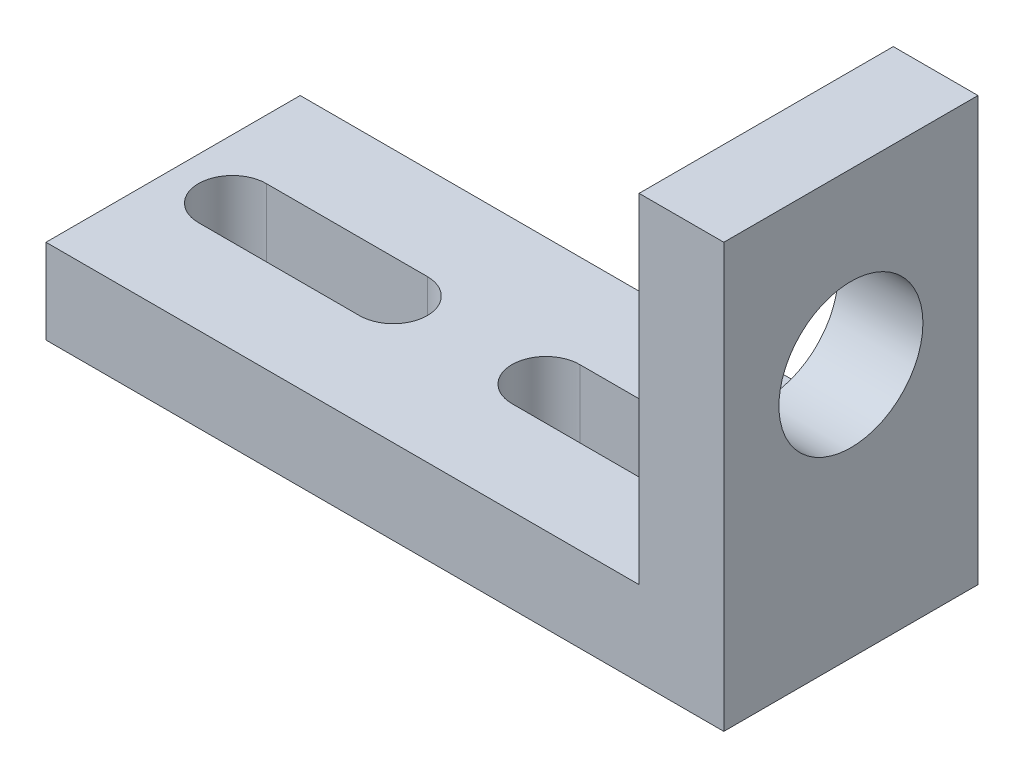
ISO-10303-21;
HEADER;
FILE_DESCRIPTION(('STEP AP214'),'2;1');
FILE_NAME('part.step','',(''),(''),'','','');
FILE_SCHEMA(('AUTOMOTIVE_DESIGN { 1 0 10303 214 1 1 1 1 }'));
ENDSEC;
DATA;
#1=APPLICATION_CONTEXT('core data for automotive mechanical design processes');
#2=APPLICATION_PROTOCOL_DEFINITION('international standard','automotive_design',2000,#1);
#3=PRODUCT_CONTEXT('',#1,'mechanical');
#4=PRODUCT('Part','Part','',(#3));
#5=PRODUCT_RELATED_PRODUCT_CATEGORY('part','',(#4));
#6=PRODUCT_DEFINITION_FORMATION('','',#4);
#7=PRODUCT_DEFINITION_CONTEXT('part definition',#1,'design');
#8=PRODUCT_DEFINITION('design','',#6,#7);
#9=PRODUCT_DEFINITION_SHAPE('','',#8);
#10=(LENGTH_UNIT() NAMED_UNIT(*) SI_UNIT(.MILLI.,.METRE.));
#11=(NAMED_UNIT(*) PLANE_ANGLE_UNIT() SI_UNIT($,.RADIAN.));
#12=(NAMED_UNIT(*) SI_UNIT($,.STERADIAN.) SOLID_ANGLE_UNIT());
#13=UNCERTAINTY_MEASURE_WITH_UNIT(LENGTH_MEASURE(1.E-05),#10,'distance_accuracy_value','');
#14=(GEOMETRIC_REPRESENTATION_CONTEXT(3) GLOBAL_UNCERTAINTY_ASSIGNED_CONTEXT((#13)) GLOBAL_UNIT_ASSIGNED_CONTEXT((#10,
#11,#12)) REPRESENTATION_CONTEXT('',''));
#15=CARTESIAN_POINT('',(0.,0.,0.));
#16=DIRECTION('',(0.,0.,1.));
#17=DIRECTION('',(1.,0.,0.));
#18=AXIS2_PLACEMENT_3D('',#15,#16,#17);
#19=CARTESIAN_POINT('',(0.,5.,0.));
#20=DIRECTION('',(0.,-1.,0.));
#21=DIRECTION('',(0.,0.,-1.));
#22=AXIS2_PLACEMENT_3D('',#19,#20,#21);
#23=PLANE('',#22);
#24=DIRECTION('',(1.,0.,0.));
#25=VECTOR('',#24,1.);
#26=CARTESIAN_POINT('',(-16.5,5.,2.));
#27=LINE('',#26,#25);
#28=CARTESIAN_POINT('',(-16.5,5.,2.));
#29=VERTEX_POINT('',#28);
#30=CARTESIAN_POINT('',(-7.,5.,2.));
#31=VERTEX_POINT('',#30);
#32=EDGE_CURVE('E150',#29,#31,#27,.T.);
#33=ORIENTED_EDGE('',*,*,#32,.F.);
#34=CARTESIAN_POINT('',(-16.5,5.,0.));
#35=DIRECTION('',(0.,1.,0.));
#36=DIRECTION('',(0.,0.,1.));
#37=AXIS2_PLACEMENT_3D('',#34,#35,#36);
#38=CIRCLE('',#37,2.);
#39=CARTESIAN_POINT('',(-16.5,5.,-2.));
#40=VERTEX_POINT('',#39);
#41=EDGE_CURVE('E48',#40,#29,#38,.T.);
#42=ORIENTED_EDGE('',*,*,#41,.F.);
#43=DIRECTION('',(-1.,0.,0.));
#44=VECTOR('',#43,1.);
#45=CARTESIAN_POINT('',(-16.5,5.,-2.));
#46=LINE('',#45,#44);
#47=CARTESIAN_POINT('',(-7.,5.,-2.));
#48=VERTEX_POINT('',#47);
#49=EDGE_CURVE('E156',#48,#40,#46,.T.);
#50=ORIENTED_EDGE('',*,*,#49,.F.);
#51=CARTESIAN_POINT('',(-7.,5.,0.));
#52=DIRECTION('',(0.,1.,0.));
#53=DIRECTION('',(0.,0.,1.));
#54=AXIS2_PLACEMENT_3D('',#51,#52,#53);
#55=CIRCLE('',#54,2.);
#56=EDGE_CURVE('E140',#31,#48,#55,.T.);
#57=ORIENTED_EDGE('',*,*,#56,.F.);
#58=EDGE_LOOP('',(#33,#42,#50,#57));
#59=FACE_BOUND('',#58,.T.);
#60=DIRECTION('',(-1.,0.,0.));
#61=VECTOR('',#60,1.);
#62=CARTESIAN_POINT('',(11.5,5.,-2.));
#63=LINE('',#62,#61);
#64=CARTESIAN_POINT('',(11.5,5.,-2.));
#65=VERTEX_POINT('',#64);
#66=CARTESIAN_POINT('',(2.00000000000001,5.,-2.));
#67=VERTEX_POINT('',#66);
#68=EDGE_CURVE('E167',#65,#67,#63,.T.);
#69=ORIENTED_EDGE('',*,*,#68,.F.);
#70=CARTESIAN_POINT('',(11.5,5.,0.));
#71=DIRECTION('',(0.,1.,0.));
#72=DIRECTION('',(0.,0.,-1.));
#73=AXIS2_PLACEMENT_3D('',#70,#71,#72);
#74=CIRCLE('',#73,2.);
#75=CARTESIAN_POINT('',(11.5,5.,1.99999999999999));
#76=VERTEX_POINT('',#75);
#77=EDGE_CURVE('E56',#76,#65,#74,.T.);
#78=ORIENTED_EDGE('',*,*,#77,.F.);
#79=DIRECTION('',(1.,0.,0.));
#80=VECTOR('',#79,1.);
#81=CARTESIAN_POINT('',(11.5,5.,1.99999999999999));
#82=LINE('',#81,#80);
#83=CARTESIAN_POINT('',(2.00000000000001,5.,2.));
#84=VERTEX_POINT('',#83);
#85=EDGE_CURVE('E173',#84,#76,#82,.T.);
#86=ORIENTED_EDGE('',*,*,#85,.F.);
#87=CARTESIAN_POINT('',(2.00000000000001,5.,0.));
#88=DIRECTION('',(0.,1.,0.));
#89=DIRECTION('',(0.,0.,-1.));
#90=AXIS2_PLACEMENT_3D('',#87,#88,#89);
#91=CIRCLE('',#90,2.);
#92=EDGE_CURVE('E170',#67,#84,#91,.T.);
#93=ORIENTED_EDGE('',*,*,#92,.F.);
#94=EDGE_LOOP('',(#69,#78,#86,#93));
#95=FACE_BOUND('',#94,.T.);
#96=DIRECTION('',(0.,0.,1.));
#97=VECTOR('',#96,1.);
#98=CARTESIAN_POINT('',(15.,5.,7.5));
#99=LINE('',#98,#97);
#100=CARTESIAN_POINT('',(15.,5.,-7.5));
#101=VERTEX_POINT('',#100);
#102=CARTESIAN_POINT('',(15.,5.,7.5));
#103=VERTEX_POINT('',#102);
#104=EDGE_CURVE('E191',#101,#103,#99,.T.);
#105=ORIENTED_EDGE('',*,*,#104,.F.);
#106=DIRECTION('',(-1.,0.,0.));
#107=VECTOR('',#106,1.);
#108=CARTESIAN_POINT('',(-20.,5.,-7.5));
#109=LINE('',#108,#107);
#110=CARTESIAN_POINT('',(-20.,5.,-7.5));
#111=VERTEX_POINT('',#110);
#112=EDGE_CURVE('E213',#101,#111,#109,.T.);
#113=ORIENTED_EDGE('',*,*,#112,.T.);
#114=DIRECTION('',(0.,0.,1.));
#115=VECTOR('',#114,1.);
#116=CARTESIAN_POINT('',(-20.,5.,7.5));
#117=LINE('',#116,#115);
#118=CARTESIAN_POINT('',(-20.,5.,7.5));
#119=VERTEX_POINT('',#118);
#120=EDGE_CURVE('E207',#111,#119,#117,.T.);
#121=ORIENTED_EDGE('',*,*,#120,.T.);
#122=DIRECTION('',(1.,0.,0.));
#123=VECTOR('',#122,1.);
#124=CARTESIAN_POINT('',(-20.,5.,7.5));
#125=LINE('',#124,#123);
#126=EDGE_CURVE('E210',#119,#103,#125,.T.);
#127=ORIENTED_EDGE('',*,*,#126,.T.);
#128=EDGE_LOOP('',(#105,#113,#121,#127));
#129=FACE_BOUND('',#128,.T.);
#130=ADVANCED_FACE('F33',(#59,#95,#129),#23,.F.);
#131=CARTESIAN_POINT('',(-20.,5.,7.5));
#132=DIRECTION('',(1.,0.,0.));
#133=DIRECTION('',(0.,0.,-1.));
#134=AXIS2_PLACEMENT_3D('',#131,#132,#133);
#135=PLANE('',#134);
#136=DIRECTION('',(0.,0.,1.));
#137=VECTOR('',#136,1.);
#138=CARTESIAN_POINT('',(-20.,0.,7.5));
#139=LINE('',#138,#137);
#140=CARTESIAN_POINT('',(-20.,0.,-7.5));
#141=VERTEX_POINT('',#140);
#142=CARTESIAN_POINT('',(-20.,0.,7.5));
#143=VERTEX_POINT('',#142);
#144=EDGE_CURVE('E206',#141,#143,#139,.T.);
#145=ORIENTED_EDGE('',*,*,#144,.T.);
#146=DIRECTION('',(0.,-1.,0.));
#147=VECTOR('',#146,1.);
#148=CARTESIAN_POINT('',(-20.,5.,7.5));
#149=LINE('',#148,#147);
#150=EDGE_CURVE('E231',#119,#143,#149,.T.);
#151=ORIENTED_EDGE('',*,*,#150,.F.);
#152=ORIENTED_EDGE('',*,*,#120,.F.);
#153=DIRECTION('',(0.,-1.,0.));
#154=VECTOR('',#153,1.);
#155=CARTESIAN_POINT('',(-20.,5.,-7.5));
#156=LINE('',#155,#154);
#157=EDGE_CURVE('E215',#111,#141,#156,.T.);
#158=ORIENTED_EDGE('',*,*,#157,.T.);
#159=EDGE_LOOP('',(#145,#151,#152,#158));
#160=FACE_BOUND('',#159,.T.);
#161=ADVANCED_FACE('F35',(#160),#135,.F.);
#162=CARTESIAN_POINT('',(-20.,5.,7.5));
#163=DIRECTION('',(0.,0.,-1.));
#164=DIRECTION('',(-1.,0.,0.));
#165=AXIS2_PLACEMENT_3D('',#162,#163,#164);
#166=PLANE('',#165);
#167=DIRECTION('',(1.,0.,0.));
#168=VECTOR('',#167,1.);
#169=CARTESIAN_POINT('',(-20.,0.,7.5));
#170=LINE('',#169,#168);
#171=CARTESIAN_POINT('',(20.,0.,7.5));
#172=VERTEX_POINT('',#171);
#173=EDGE_CURVE('E218',#143,#172,#170,.T.);
#174=ORIENTED_EDGE('',*,*,#173,.T.);
#175=DIRECTION('',(0.,-1.,0.));
#176=VECTOR('',#175,1.);
#177=CARTESIAN_POINT('',(20.,5.,7.5));
#178=LINE('',#177,#176);
#179=CARTESIAN_POINT('',(20.,25.,7.5));
#180=VERTEX_POINT('',#179);
#181=EDGE_CURVE('E228',#180,#172,#178,.T.);
#182=ORIENTED_EDGE('',*,*,#181,.F.);
#183=DIRECTION('',(1.,0.,0.));
#184=VECTOR('',#183,1.);
#185=CARTESIAN_POINT('',(20.,25.,7.5));
#186=LINE('',#185,#184);
#187=CARTESIAN_POINT('',(15.,25.,7.5));
#188=VERTEX_POINT('',#187);
#189=EDGE_CURVE('E195',#188,#180,#186,.T.);
#190=ORIENTED_EDGE('',*,*,#189,.F.);
#191=DIRECTION('',(0.,-1.,0.));
#192=VECTOR('',#191,1.);
#193=CARTESIAN_POINT('',(15.,25.,7.5));
#194=LINE('',#193,#192);
#195=EDGE_CURVE('E198',#188,#103,#194,.T.);
#196=ORIENTED_EDGE('',*,*,#195,.T.);
#197=ORIENTED_EDGE('',*,*,#126,.F.);
#198=ORIENTED_EDGE('',*,*,#150,.T.);
#199=EDGE_LOOP('',(#174,#182,#190,#196,#197,#198));
#200=FACE_BOUND('',#199,.T.);
#201=ADVANCED_FACE('F274',(#200),#166,.F.);
#202=CARTESIAN_POINT('',(20.,5.,7.5));
#203=DIRECTION('',(-1.,0.,0.));
#204=DIRECTION('',(0.,0.,1.));
#205=AXIS2_PLACEMENT_3D('',#202,#203,#204);
#206=PLANE('',#205);
#207=CARTESIAN_POINT('',(20.,15.,0.));
#208=DIRECTION('',(1.,0.,0.));
#209=DIRECTION('',(0.,0.,-1.));
#210=AXIS2_PLACEMENT_3D('',#207,#208,#209);
#211=CIRCLE('',#210,4.25);
#212=CARTESIAN_POINT('',(20.,15.,-4.25000000000001));
#213=VERTEX_POINT('',#212);
#214=EDGE_CURVE('E163',#213,#213,#211,.T.);
#215=ORIENTED_EDGE('',*,*,#214,.F.);
#216=EDGE_LOOP('',(#215));
#217=FACE_BOUND('',#216,.T.);
#218=DIRECTION('',(0.,0.,-1.));
#219=VECTOR('',#218,1.);
#220=CARTESIAN_POINT('',(20.,0.,7.5));
#221=LINE('',#220,#219);
#222=CARTESIAN_POINT('',(20.,0.,-7.5));
#223=VERTEX_POINT('',#222);
#224=EDGE_CURVE('E220',#172,#223,#221,.T.);
#225=ORIENTED_EDGE('',*,*,#224,.T.);
#226=DIRECTION('',(0.,-1.,0.));
#227=VECTOR('',#226,1.);
#228=CARTESIAN_POINT('',(20.,5.,-7.5));
#229=LINE('',#228,#227);
#230=CARTESIAN_POINT('',(20.,25.,-7.5));
#231=VERTEX_POINT('',#230);
#232=EDGE_CURVE('E225',#231,#223,#229,.T.);
#233=ORIENTED_EDGE('',*,*,#232,.F.);
#234=DIRECTION('',(0.,0.,-1.));
#235=VECTOR('',#234,1.);
#236=CARTESIAN_POINT('',(20.,25.,-7.5));
#237=LINE('',#236,#235);
#238=EDGE_CURVE('E187',#180,#231,#237,.T.);
#239=ORIENTED_EDGE('',*,*,#238,.F.);
#240=ORIENTED_EDGE('',*,*,#181,.T.);
#241=EDGE_LOOP('',(#225,#233,#239,#240));
#242=FACE_BOUND('',#241,.T.);
#243=ADVANCED_FACE('F285',(#217,#242),#206,.F.);
#244=CARTESIAN_POINT('',(-20.,5.,-7.5));
#245=DIRECTION('',(0.,0.,1.));
#246=DIRECTION('',(1.,0.,0.));
#247=AXIS2_PLACEMENT_3D('',#244,#245,#246);
#248=PLANE('',#247);
#249=DIRECTION('',(-1.,0.,0.));
#250=VECTOR('',#249,1.);
#251=CARTESIAN_POINT('',(-20.,0.,-7.5));
#252=LINE('',#251,#250);
#253=EDGE_CURVE('E211',#223,#141,#252,.T.);
#254=ORIENTED_EDGE('',*,*,#253,.T.);
#255=ORIENTED_EDGE('',*,*,#157,.F.);
#256=ORIENTED_EDGE('',*,*,#112,.F.);
#257=DIRECTION('',(0.,-1.,0.));
#258=VECTOR('',#257,1.);
#259=CARTESIAN_POINT('',(15.,25.,-7.5));
#260=LINE('',#259,#258);
#261=CARTESIAN_POINT('',(15.,25.,-7.5));
#262=VERTEX_POINT('',#261);
#263=EDGE_CURVE('E203',#262,#101,#260,.T.);
#264=ORIENTED_EDGE('',*,*,#263,.F.);
#265=DIRECTION('',(-1.,0.,0.));
#266=VECTOR('',#265,1.);
#267=CARTESIAN_POINT('',(15.,25.,-7.5));
#268=LINE('',#267,#266);
#269=EDGE_CURVE('E190',#231,#262,#268,.T.);
#270=ORIENTED_EDGE('',*,*,#269,.F.);
#271=ORIENTED_EDGE('',*,*,#232,.T.);
#272=EDGE_LOOP('',(#254,#255,#256,#264,#270,#271));
#273=FACE_BOUND('',#272,.T.);
#274=ADVANCED_FACE('F282',(#273),#248,.F.);
#275=CARTESIAN_POINT('',(0.,0.,0.));
#276=DIRECTION('',(0.,-1.,0.));
#277=DIRECTION('',(0.,0.,-1.));
#278=AXIS2_PLACEMENT_3D('',#275,#276,#277);
#279=PLANE('',#278);
#280=CARTESIAN_POINT('',(-16.5,0.,0.));
#281=DIRECTION('',(0.,-1.,0.));
#282=DIRECTION('',(0.,0.,-1.));
#283=AXIS2_PLACEMENT_3D('',#280,#281,#282);
#284=CIRCLE('',#283,2.);
#285=CARTESIAN_POINT('',(-16.5,0.,2.));
#286=VERTEX_POINT('',#285);
#287=CARTESIAN_POINT('',(-16.5,0.,-2.));
#288=VERTEX_POINT('',#287);
#289=EDGE_CURVE('E11',#286,#288,#284,.T.);
#290=ORIENTED_EDGE('',*,*,#289,.F.);
#291=DIRECTION('',(-1.,0.,0.));
#292=VECTOR('',#291,1.);
#293=CARTESIAN_POINT('',(0.,0.,2.));
#294=LINE('',#293,#292);
#295=CARTESIAN_POINT('',(-7.,0.,2.));
#296=VERTEX_POINT('',#295);
#297=EDGE_CURVE('E245',#296,#286,#294,.T.);
#298=ORIENTED_EDGE('',*,*,#297,.F.);
#299=CARTESIAN_POINT('',(-7.,0.,0.));
#300=DIRECTION('',(0.,-1.,0.));
#301=DIRECTION('',(0.,0.,-1.));
#302=AXIS2_PLACEMENT_3D('',#299,#300,#301);
#303=CIRCLE('',#302,2.);
#304=CARTESIAN_POINT('',(-7.,0.,-2.));
#305=VERTEX_POINT('',#304);
#306=EDGE_CURVE('E143',#305,#296,#303,.T.);
#307=ORIENTED_EDGE('',*,*,#306,.F.);
#308=DIRECTION('',(1.,0.,0.));
#309=VECTOR('',#308,1.);
#310=CARTESIAN_POINT('',(0.,0.,-2.));
#311=LINE('',#310,#309);
#312=EDGE_CURVE('E41',#288,#305,#311,.T.);
#313=ORIENTED_EDGE('',*,*,#312,.F.);
#314=EDGE_LOOP('',(#290,#298,#307,#313));
#315=FACE_BOUND('',#314,.T.);
#316=CARTESIAN_POINT('',(11.5,0.,0.));
#317=DIRECTION('',(0.,-1.,0.));
#318=DIRECTION('',(0.,0.,-1.));
#319=AXIS2_PLACEMENT_3D('',#316,#317,#318);
#320=CIRCLE('',#319,2.);
#321=CARTESIAN_POINT('',(11.5,0.,-2.));
#322=VERTEX_POINT('',#321);
#323=CARTESIAN_POINT('',(11.5,0.,1.99999999999999));
#324=VERTEX_POINT('',#323);
#325=EDGE_CURVE('E243',#322,#324,#320,.T.);
#326=ORIENTED_EDGE('',*,*,#325,.F.);
#327=DIRECTION('',(1.,0.,0.));
#328=VECTOR('',#327,1.);
#329=CARTESIAN_POINT('',(0.,0.,-2.));
#330=LINE('',#329,#328);
#331=CARTESIAN_POINT('',(2.00000000000001,0.,-2.));
#332=VERTEX_POINT('',#331);
#333=EDGE_CURVE('E234',#332,#322,#330,.T.);
#334=ORIENTED_EDGE('',*,*,#333,.F.);
#335=CARTESIAN_POINT('',(2.00000000000001,0.,0.));
#336=DIRECTION('',(0.,-1.,0.));
#337=DIRECTION('',(0.,0.,-1.));
#338=AXIS2_PLACEMENT_3D('',#335,#336,#337);
#339=CIRCLE('',#338,2.);
#340=CARTESIAN_POINT('',(2.00000000000001,0.,2.));
#341=VERTEX_POINT('',#340);
#342=EDGE_CURVE('E238',#341,#332,#339,.T.);
#343=ORIENTED_EDGE('',*,*,#342,.F.);
#344=DIRECTION('',(-1.,0.,0.));
#345=VECTOR('',#344,1.);
#346=CARTESIAN_POINT('',(0.,0.,1.99999999999999));
#347=LINE('',#346,#345);
#348=EDGE_CURVE('E241',#324,#341,#347,.T.);
#349=ORIENTED_EDGE('',*,*,#348,.F.);
#350=EDGE_LOOP('',(#326,#334,#343,#349));
#351=FACE_BOUND('',#350,.T.);
#352=ORIENTED_EDGE('',*,*,#144,.F.);
#353=ORIENTED_EDGE('',*,*,#253,.F.);
#354=ORIENTED_EDGE('',*,*,#224,.F.);
#355=ORIENTED_EDGE('',*,*,#173,.F.);
#356=EDGE_LOOP('',(#352,#353,#354,#355));
#357=FACE_BOUND('',#356,.T.);
#358=ADVANCED_FACE('F253',(#315,#351,#357),#279,.T.);
#359=CARTESIAN_POINT('',(15.,25.,7.5));
#360=DIRECTION('',(1.,0.,0.));
#361=DIRECTION('',(0.,0.,-1.));
#362=AXIS2_PLACEMENT_3D('',#359,#360,#361);
#363=PLANE('',#362);
#364=CARTESIAN_POINT('',(15.,15.,0.));
#365=DIRECTION('',(1.,0.,0.));
#366=DIRECTION('',(0.,0.,-1.));
#367=AXIS2_PLACEMENT_3D('',#364,#365,#366);
#368=CIRCLE('',#367,4.25);
#369=CARTESIAN_POINT('',(15.,15.,-4.25));
#370=VERTEX_POINT('',#369);
#371=EDGE_CURVE('E186',#370,#370,#368,.T.);
#372=ORIENTED_EDGE('',*,*,#371,.T.);
#373=EDGE_LOOP('',(#372));
#374=FACE_BOUND('',#373,.T.);
#375=ORIENTED_EDGE('',*,*,#104,.T.);
#376=ORIENTED_EDGE('',*,*,#195,.F.);
#377=DIRECTION('',(0.,0.,1.));
#378=VECTOR('',#377,1.);
#379=CARTESIAN_POINT('',(15.,25.,7.5));
#380=LINE('',#379,#378);
#381=EDGE_CURVE('E193',#262,#188,#380,.T.);
#382=ORIENTED_EDGE('',*,*,#381,.F.);
#383=ORIENTED_EDGE('',*,*,#263,.T.);
#384=EDGE_LOOP('',(#375,#376,#382,#383));
#385=FACE_BOUND('',#384,.T.);
#386=ADVANCED_FACE('F278',(#374,#385),#363,.F.);
#387=CARTESIAN_POINT('',(0.,25.,0.));
#388=DIRECTION('',(0.,-1.,0.));
#389=DIRECTION('',(0.,0.,-1.));
#390=AXIS2_PLACEMENT_3D('',#387,#388,#389);
#391=PLANE('',#390);
#392=ORIENTED_EDGE('',*,*,#238,.T.);
#393=ORIENTED_EDGE('',*,*,#269,.T.);
#394=ORIENTED_EDGE('',*,*,#381,.T.);
#395=ORIENTED_EDGE('',*,*,#189,.T.);
#396=EDGE_LOOP('',(#392,#393,#394,#395));
#397=FACE_BOUND('',#396,.T.);
#398=ADVANCED_FACE('F311',(#397),#391,.F.);
#399=CARTESIAN_POINT('',(0.,15.,0.));
#400=DIRECTION('',(1.,0.,0.));
#401=DIRECTION('',(0.,0.,-1.));
#402=AXIS2_PLACEMENT_3D('',#399,#400,#401);
#403=CYLINDRICAL_SURFACE('',#402,4.25);
#404=ORIENTED_EDGE('',*,*,#214,.T.);
#405=EDGE_LOOP('',(#404));
#406=FACE_BOUND('',#405,.T.);
#407=ORIENTED_EDGE('',*,*,#371,.F.);
#408=EDGE_LOOP('',(#407));
#409=FACE_BOUND('',#408,.T.);
#410=ADVANCED_FACE('F313',(#406,#409),#403,.F.);
#411=CARTESIAN_POINT('',(11.5,-15.,0.));
#412=DIRECTION('',(0.,1.,0.));
#413=DIRECTION('',(0.,0.,1.));
#414=AXIS2_PLACEMENT_3D('',#411,#412,#413);
#415=CYLINDRICAL_SURFACE('',#414,2.);
#416=ORIENTED_EDGE('',*,*,#325,.T.);
#417=DIRECTION('',(0.,1.,0.));
#418=VECTOR('',#417,1.);
#419=CARTESIAN_POINT('',(11.5,-15.,1.99999999999999));
#420=LINE('',#419,#418);
#421=EDGE_CURVE('E177',#324,#76,#420,.T.);
#422=ORIENTED_EDGE('',*,*,#421,.T.);
#423=ORIENTED_EDGE('',*,*,#77,.T.);
#424=DIRECTION('',(0.,1.,0.));
#425=VECTOR('',#424,1.);
#426=CARTESIAN_POINT('',(11.5,-15.,-2.));
#427=LINE('',#426,#425);
#428=EDGE_CURVE('E176',#322,#65,#427,.T.);
#429=ORIENTED_EDGE('',*,*,#428,.F.);
#430=EDGE_LOOP('',(#416,#422,#423,#429));
#431=FACE_BOUND('',#430,.T.);
#432=ADVANCED_FACE('F318',(#431),#415,.F.);
#433=CARTESIAN_POINT('',(11.5,-15.,1.99999999999999));
#434=DIRECTION('',(0.,0.,1.));
#435=DIRECTION('',(1.,0.,0.));
#436=AXIS2_PLACEMENT_3D('',#433,#434,#435);
#437=PLANE('',#436);
#438=ORIENTED_EDGE('',*,*,#348,.T.);
#439=DIRECTION('',(0.,1.,0.));
#440=VECTOR('',#439,1.);
#441=CARTESIAN_POINT('',(2.00000000000001,-15.,2.));
#442=LINE('',#441,#440);
#443=EDGE_CURVE('E179',#341,#84,#442,.T.);
#444=ORIENTED_EDGE('',*,*,#443,.T.);
#445=ORIENTED_EDGE('',*,*,#85,.T.);
#446=ORIENTED_EDGE('',*,*,#421,.F.);
#447=EDGE_LOOP('',(#438,#444,#445,#446));
#448=FACE_BOUND('',#447,.T.);
#449=ADVANCED_FACE('F324',(#448),#437,.F.);
#450=CARTESIAN_POINT('',(2.00000000000001,-15.,0.));
#451=DIRECTION('',(0.,1.,0.));
#452=DIRECTION('',(0.,0.,1.));
#453=AXIS2_PLACEMENT_3D('',#450,#451,#452);
#454=CYLINDRICAL_SURFACE('',#453,2.);
#455=ORIENTED_EDGE('',*,*,#342,.T.);
#456=DIRECTION('',(0.,1.,0.));
#457=VECTOR('',#456,1.);
#458=CARTESIAN_POINT('',(2.00000000000001,-15.,-2.));
#459=LINE('',#458,#457);
#460=EDGE_CURVE('E181',#332,#67,#459,.T.);
#461=ORIENTED_EDGE('',*,*,#460,.T.);
#462=ORIENTED_EDGE('',*,*,#92,.T.);
#463=ORIENTED_EDGE('',*,*,#443,.F.);
#464=EDGE_LOOP('',(#455,#461,#462,#463));
#465=FACE_BOUND('',#464,.T.);
#466=ADVANCED_FACE('F264',(#465),#454,.F.);
#467=CARTESIAN_POINT('',(11.5,-15.,-2.));
#468=DIRECTION('',(0.,0.,-1.));
#469=DIRECTION('',(-1.,0.,0.));
#470=AXIS2_PLACEMENT_3D('',#467,#468,#469);
#471=PLANE('',#470);
#472=ORIENTED_EDGE('',*,*,#333,.T.);
#473=ORIENTED_EDGE('',*,*,#428,.T.);
#474=ORIENTED_EDGE('',*,*,#68,.T.);
#475=ORIENTED_EDGE('',*,*,#460,.F.);
#476=EDGE_LOOP('',(#472,#473,#474,#475));
#477=FACE_BOUND('',#476,.T.);
#478=ADVANCED_FACE('F257',(#477),#471,.F.);
#479=CARTESIAN_POINT('',(-16.5,-15.,0.));
#480=DIRECTION('',(0.,1.,0.));
#481=DIRECTION('',(0.,0.,1.));
#482=AXIS2_PLACEMENT_3D('',#479,#480,#481);
#483=CYLINDRICAL_SURFACE('',#482,2.);
#484=ORIENTED_EDGE('',*,*,#289,.T.);
#485=DIRECTION('',(0.,1.,0.));
#486=VECTOR('',#485,1.);
#487=CARTESIAN_POINT('',(-16.5,-15.,-2.));
#488=LINE('',#487,#486);
#489=EDGE_CURVE('E161',#288,#40,#488,.T.);
#490=ORIENTED_EDGE('',*,*,#489,.T.);
#491=ORIENTED_EDGE('',*,*,#41,.T.);
#492=DIRECTION('',(0.,1.,0.));
#493=VECTOR('',#492,1.);
#494=CARTESIAN_POINT('',(-16.5,-15.,2.));
#495=LINE('',#494,#493);
#496=EDGE_CURVE('E147',#286,#29,#495,.T.);
#497=ORIENTED_EDGE('',*,*,#496,.F.);
#498=EDGE_LOOP('',(#484,#490,#491,#497));
#499=FACE_BOUND('',#498,.T.);
#500=ADVANCED_FACE('F255',(#499),#483,.F.);
#501=CARTESIAN_POINT('',(-16.5,-15.,-2.));
#502=DIRECTION('',(0.,0.,-1.));
#503=DIRECTION('',(-1.,0.,0.));
#504=AXIS2_PLACEMENT_3D('',#501,#502,#503);
#505=PLANE('',#504);
#506=ORIENTED_EDGE('',*,*,#312,.T.);
#507=DIRECTION('',(0.,1.,0.));
#508=VECTOR('',#507,1.);
#509=CARTESIAN_POINT('',(-7.,-15.,-2.));
#510=LINE('',#509,#508);
#511=EDGE_CURVE('E146',#305,#48,#510,.T.);
#512=ORIENTED_EDGE('',*,*,#511,.T.);
#513=ORIENTED_EDGE('',*,*,#49,.T.);
#514=ORIENTED_EDGE('',*,*,#489,.F.);
#515=EDGE_LOOP('',(#506,#512,#513,#514));
#516=FACE_BOUND('',#515,.T.);
#517=ADVANCED_FACE('F250',(#516),#505,.F.);
#518=CARTESIAN_POINT('',(-7.,-15.,0.));
#519=DIRECTION('',(0.,1.,0.));
#520=DIRECTION('',(0.,0.,1.));
#521=AXIS2_PLACEMENT_3D('',#518,#519,#520);
#522=CYLINDRICAL_SURFACE('',#521,2.);
#523=ORIENTED_EDGE('',*,*,#306,.T.);
#524=DIRECTION('',(0.,1.,0.));
#525=VECTOR('',#524,1.);
#526=CARTESIAN_POINT('',(-7.,-15.,2.));
#527=LINE('',#526,#525);
#528=EDGE_CURVE('E135',#296,#31,#527,.T.);
#529=ORIENTED_EDGE('',*,*,#528,.T.);
#530=ORIENTED_EDGE('',*,*,#56,.T.);
#531=ORIENTED_EDGE('',*,*,#511,.F.);
#532=EDGE_LOOP('',(#523,#529,#530,#531));
#533=FACE_BOUND('',#532,.T.);
#534=ADVANCED_FACE('F137',(#533),#522,.F.);
#535=CARTESIAN_POINT('',(-16.5,-15.,2.));
#536=DIRECTION('',(0.,0.,1.));
#537=DIRECTION('',(1.,0.,0.));
#538=AXIS2_PLACEMENT_3D('',#535,#536,#537);
#539=PLANE('',#538);
#540=ORIENTED_EDGE('',*,*,#297,.T.);
#541=ORIENTED_EDGE('',*,*,#496,.T.);
#542=ORIENTED_EDGE('',*,*,#32,.T.);
#543=ORIENTED_EDGE('',*,*,#528,.F.);
#544=EDGE_LOOP('',(#540,#541,#542,#543));
#545=FACE_BOUND('',#544,.T.);
#546=ADVANCED_FACE('F151',(#545),#539,.F.);
#547=CLOSED_SHELL('',(#130,#161,#201,#243,#274,#358,#386,#398,#410,#432,#449,#466,#478,#500,
#517,#534,#546));
#548=MANIFOLD_SOLID_BREP('B2',#547);
#549=ADVANCED_BREP_SHAPE_REPRESENTATION('',(#18,#548),#14);
#550=SHAPE_DEFINITION_REPRESENTATION(#9,#549);
ENDSEC;
END-ISO-10303-21;
